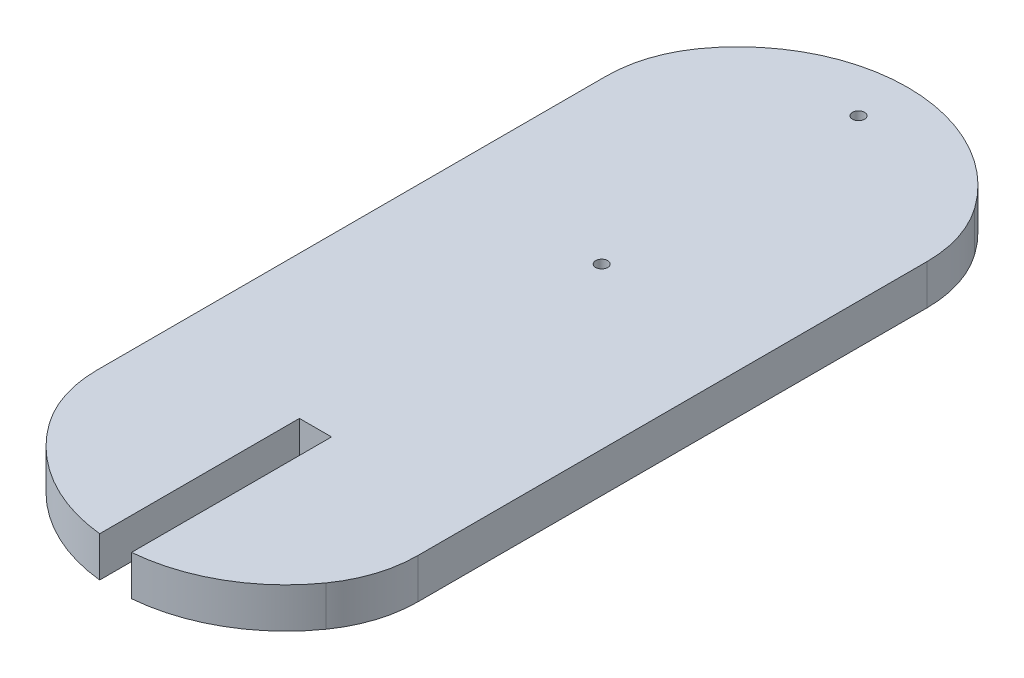
ISO-10303-21;
HEADER;
FILE_DESCRIPTION(('STEP AP214'),'2;1');
FILE_NAME('part.step','',(''),(''),'','','');
FILE_SCHEMA(('AUTOMOTIVE_DESIGN { 1 0 10303 214 1 1 1 1 }'));
ENDSEC;
DATA;
#1=APPLICATION_CONTEXT('core data for automotive mechanical design processes');
#2=APPLICATION_PROTOCOL_DEFINITION('international standard','automotive_design',2000,#1);
#3=PRODUCT_CONTEXT('',#1,'mechanical');
#4=PRODUCT('Part','Part','',(#3));
#5=PRODUCT_RELATED_PRODUCT_CATEGORY('part','',(#4));
#6=PRODUCT_DEFINITION_FORMATION('','',#4);
#7=PRODUCT_DEFINITION_CONTEXT('part definition',#1,'design');
#8=PRODUCT_DEFINITION('design','',#6,#7);
#9=PRODUCT_DEFINITION_SHAPE('','',#8);
#10=(LENGTH_UNIT() NAMED_UNIT(*) SI_UNIT(.MILLI.,.METRE.));
#11=(NAMED_UNIT(*) PLANE_ANGLE_UNIT() SI_UNIT($,.RADIAN.));
#12=(NAMED_UNIT(*) SI_UNIT($,.STERADIAN.) SOLID_ANGLE_UNIT());
#13=UNCERTAINTY_MEASURE_WITH_UNIT(LENGTH_MEASURE(1.E-05),#10,'distance_accuracy_value','');
#14=(GEOMETRIC_REPRESENTATION_CONTEXT(3) GLOBAL_UNCERTAINTY_ASSIGNED_CONTEXT((#13)) GLOBAL_UNIT_ASSIGNED_CONTEXT((#10,
#11,#12)) REPRESENTATION_CONTEXT('',''));
#15=CARTESIAN_POINT('',(0.,0.,0.));
#16=DIRECTION('',(0.,0.,1.));
#17=DIRECTION('',(1.,0.,0.));
#18=AXIS2_PLACEMENT_3D('',#15,#16,#17);
#19=CARTESIAN_POINT('',(0.,5.,28.1826031360937));
#20=DIRECTION('',(0.,-1.,0.));
#21=DIRECTION('',(0.,0.,-1.));
#22=AXIS2_PLACEMENT_3D('',#19,#20,#21);
#23=CYLINDRICAL_SURFACE('',#22,21.13);
#24=CARTESIAN_POINT('',(0.,5.,28.1826031360937));
#25=DIRECTION('',(0.,1.,0.));
#26=DIRECTION('',(0.,0.,1.));
#27=AXIS2_PLACEMENT_3D('',#24,#25,#26);
#28=CIRCLE('',#27,21.13);
#29=CARTESIAN_POINT('',(1.82374823296328,5.,49.2337513799012));
#30=VERTEX_POINT('',#29);
#31=CARTESIAN_POINT('',(17.2349102773246,5.,40.406954559894));
#32=VERTEX_POINT('',#31);
#33=EDGE_CURVE('E164',#30,#32,#28,.T.);
#34=ORIENTED_EDGE('',*,*,#33,.F.);
#35=DIRECTION('',(0.,-1.,0.));
#36=VECTOR('',#35,1.);
#37=CARTESIAN_POINT('',(1.82374823296328,5.,49.2337513799012));
#38=LINE('',#37,#36);
#39=CARTESIAN_POINT('',(1.82374823296328,0.,49.2337513799012));
#40=VERTEX_POINT('',#39);
#41=EDGE_CURVE('E158',#30,#40,#38,.T.);
#42=ORIENTED_EDGE('',*,*,#41,.T.);
#43=CARTESIAN_POINT('',(0.,0.,28.1826031360937));
#44=DIRECTION('',(0.,1.,0.));
#45=DIRECTION('',(0.,0.,1.));
#46=AXIS2_PLACEMENT_3D('',#43,#44,#45);
#47=CIRCLE('',#46,21.13);
#48=CARTESIAN_POINT('',(17.2349102773246,0.,40.406954559894));
#49=VERTEX_POINT('',#48);
#50=EDGE_CURVE('E161',#40,#49,#47,.T.);
#51=ORIENTED_EDGE('',*,*,#50,.T.);
#52=DIRECTION('',(0.,-1.,0.));
#53=VECTOR('',#52,1.);
#54=CARTESIAN_POINT('',(17.2349102773246,5.,40.406954559894));
#55=LINE('',#54,#53);
#56=EDGE_CURVE('E201',#49,#32,#55,.F.);
#57=ORIENTED_EDGE('',*,*,#56,.T.);
#58=EDGE_LOOP('',(#34,#42,#51,#57));
#59=FACE_BOUND('',#58,.T.);
#60=ADVANCED_FACE('F36',(#59),#23,.T.);
#61=CARTESIAN_POINT('',(-17.2349102773246,0.,40.406954559894));
#62=VERTEX_POINT('',#61);
#63=CARTESIAN_POINT('',(-2.17625176703672,0.,49.2002345023173));
#64=VERTEX_POINT('',#63);
#65=EDGE_CURVE('E173',#62,#64,#47,.T.);
#66=ORIENTED_EDGE('',*,*,#65,.T.);
#67=DIRECTION('',(0.,-1.,0.));
#68=VECTOR('',#67,1.);
#69=CARTESIAN_POINT('',(-2.17625176703672,5.,49.2002345023173));
#70=LINE('',#69,#68);
#71=CARTESIAN_POINT('',(-2.17625176703672,5.,49.2002345023173));
#72=VERTEX_POINT('',#71);
#73=EDGE_CURVE('E51',#64,#72,#70,.F.);
#74=ORIENTED_EDGE('',*,*,#73,.T.);
#75=CARTESIAN_POINT('',(-17.2349102773246,5.,40.406954559894));
#76=VERTEX_POINT('',#75);
#77=EDGE_CURVE('E144',#76,#72,#28,.T.);
#78=ORIENTED_EDGE('',*,*,#77,.F.);
#79=DIRECTION('',(0.,-1.,0.));
#80=VECTOR('',#79,1.);
#81=CARTESIAN_POINT('',(-17.2349102773246,5.,40.406954559894));
#82=LINE('',#81,#80);
#83=EDGE_CURVE('E198',#76,#62,#82,.T.);
#84=ORIENTED_EDGE('',*,*,#83,.T.);
#85=EDGE_LOOP('',(#66,#74,#78,#84));
#86=FACE_BOUND('',#85,.T.);
#87=ADVANCED_FACE('F240',(#86),#23,.T.);
#88=CARTESIAN_POINT('',(20.,5.,0.));
#89=DIRECTION('',(-1.,0.,0.));
#90=DIRECTION('',(0.,0.,1.));
#91=AXIS2_PLACEMENT_3D('',#88,#89,#90);
#92=PLANE('',#91);
#93=DIRECTION('',(0.,0.,-1.));
#94=VECTOR('',#93,1.);
#95=CARTESIAN_POINT('',(20.,5.,0.));
#96=LINE('',#95,#94);
#97=CARTESIAN_POINT('',(20.,5.,31.728995669359));
#98=VERTEX_POINT('',#97);
#99=CARTESIAN_POINT('',(20.,5.,-31.7243272605895));
#100=VERTEX_POINT('',#99);
#101=EDGE_CURVE('E163',#98,#100,#96,.T.);
#102=ORIENTED_EDGE('',*,*,#101,.F.);
#103=DIRECTION('',(0.,-1.,0.));
#104=VECTOR('',#103,1.);
#105=CARTESIAN_POINT('',(20.,5.,31.728995669359));
#106=LINE('',#105,#104);
#107=CARTESIAN_POINT('',(20.,0.,31.728995669359));
#108=VERTEX_POINT('',#107);
#109=EDGE_CURVE('E186',#98,#108,#106,.T.);
#110=ORIENTED_EDGE('',*,*,#109,.T.);
#111=DIRECTION('',(0.,0.,-1.));
#112=VECTOR('',#111,1.);
#113=CARTESIAN_POINT('',(20.,0.,0.));
#114=LINE('',#113,#112);
#115=CARTESIAN_POINT('',(20.,0.,-31.7243272605895));
#116=VERTEX_POINT('',#115);
#117=EDGE_CURVE('E176',#108,#116,#114,.T.);
#118=ORIENTED_EDGE('',*,*,#117,.T.);
#119=DIRECTION('',(0.,1.,0.));
#120=VECTOR('',#119,1.);
#121=CARTESIAN_POINT('',(20.,5.,-31.7243272605895));
#122=LINE('',#121,#120);
#123=EDGE_CURVE('E172',#116,#100,#122,.T.);
#124=ORIENTED_EDGE('',*,*,#123,.T.);
#125=EDGE_LOOP('',(#102,#110,#118,#124));
#126=FACE_BOUND('',#125,.T.);
#127=ADVANCED_FACE('F242',(#126),#92,.F.);
#128=CARTESIAN_POINT('',(0.,5.,-28.1720466483781));
#129=DIRECTION('',(0.,-1.,0.));
#130=DIRECTION('',(0.,0.,-1.));
#131=AXIS2_PLACEMENT_3D('',#128,#129,#130);
#132=CYLINDRICAL_SURFACE('',#131,21.1334083141344);
#133=CARTESIAN_POINT('',(0.,0.,-28.1720466483781));
#134=DIRECTION('',(0.,1.,0.));
#135=DIRECTION('',(0.,0.,1.));
#136=AXIS2_PLACEMENT_3D('',#133,#134,#135);
#137=CIRCLE('',#136,21.1334083141344);
#138=CARTESIAN_POINT('',(-17.2281113793065,0.,-40.4118638559239));
#139=VERTEX_POINT('',#138);
#140=CARTESIAN_POINT('',(17.2281113793065,0.,-40.4118638559239));
#141=VERTEX_POINT('',#140);
#142=EDGE_CURVE('E179',#139,#141,#137,.F.);
#143=ORIENTED_EDGE('',*,*,#142,.F.);
#144=DIRECTION('',(0.,-1.,0.));
#145=VECTOR('',#144,1.);
#146=CARTESIAN_POINT('',(-17.2281113793065,5.,-40.4118638559239));
#147=LINE('',#146,#145);
#148=CARTESIAN_POINT('',(-17.2281113793065,5.,-40.4118638559239));
#149=VERTEX_POINT('',#148);
#150=EDGE_CURVE('E44',#139,#149,#147,.F.);
#151=ORIENTED_EDGE('',*,*,#150,.T.);
#152=CARTESIAN_POINT('',(0.,5.,-28.1720466483781));
#153=DIRECTION('',(0.,1.,0.));
#154=DIRECTION('',(0.,0.,1.));
#155=AXIS2_PLACEMENT_3D('',#152,#153,#154);
#156=CIRCLE('',#155,21.1334083141344);
#157=CARTESIAN_POINT('',(17.2281113793065,5.,-40.4118638559239));
#158=VERTEX_POINT('',#157);
#159=EDGE_CURVE('E167',#149,#158,#156,.F.);
#160=ORIENTED_EDGE('',*,*,#159,.T.);
#161=DIRECTION('',(0.,-1.,0.));
#162=VECTOR('',#161,1.);
#163=CARTESIAN_POINT('',(17.2281113793065,5.,-40.4118638559239));
#164=LINE('',#163,#162);
#165=EDGE_CURVE('E216',#158,#141,#164,.T.);
#166=ORIENTED_EDGE('',*,*,#165,.T.);
#167=EDGE_LOOP('',(#143,#151,#160,#166));
#168=FACE_BOUND('',#167,.T.);
#169=ADVANCED_FACE('F221',(#168),#132,.T.);
#170=CARTESIAN_POINT('',(-20.,5.,0.));
#171=DIRECTION('',(-1.,0.,0.));
#172=DIRECTION('',(0.,0.,1.));
#173=AXIS2_PLACEMENT_3D('',#170,#171,#172);
#174=PLANE('',#173);
#175=DIRECTION('',(0.,0.,-1.));
#176=VECTOR('',#175,1.);
#177=CARTESIAN_POINT('',(-20.,0.,0.));
#178=LINE('',#177,#176);
#179=CARTESIAN_POINT('',(-20.,0.,31.728995669359));
#180=VERTEX_POINT('',#179);
#181=CARTESIAN_POINT('',(-20.,0.,-31.7243272605895));
#182=VERTEX_POINT('',#181);
#183=EDGE_CURVE('E182',#180,#182,#178,.T.);
#184=ORIENTED_EDGE('',*,*,#183,.F.);
#185=DIRECTION('',(0.,1.,0.));
#186=VECTOR('',#185,1.);
#187=CARTESIAN_POINT('',(-20.,5.,31.728995669359));
#188=LINE('',#187,#186);
#189=CARTESIAN_POINT('',(-20.,5.,31.728995669359));
#190=VERTEX_POINT('',#189);
#191=EDGE_CURVE('E214',#180,#190,#188,.T.);
#192=ORIENTED_EDGE('',*,*,#191,.T.);
#193=DIRECTION('',(0.,0.,-1.));
#194=VECTOR('',#193,1.);
#195=CARTESIAN_POINT('',(-20.,5.,0.));
#196=LINE('',#195,#194);
#197=CARTESIAN_POINT('',(-20.,5.,-31.7243272605895));
#198=VERTEX_POINT('',#197);
#199=EDGE_CURVE('E170',#190,#198,#196,.T.);
#200=ORIENTED_EDGE('',*,*,#199,.T.);
#201=DIRECTION('',(0.,-1.,0.));
#202=VECTOR('',#201,1.);
#203=CARTESIAN_POINT('',(-20.,5.,-31.7243272605895));
#204=LINE('',#203,#202);
#205=EDGE_CURVE('E211',#198,#182,#204,.T.);
#206=ORIENTED_EDGE('',*,*,#205,.T.);
#207=EDGE_LOOP('',(#184,#192,#200,#206));
#208=FACE_BOUND('',#207,.T.);
#209=ADVANCED_FACE('F229',(#208),#174,.T.);
#210=CARTESIAN_POINT('',(0.,5.,0.));
#211=DIRECTION('',(0.,1.,0.));
#212=DIRECTION('',(0.,0.,1.));
#213=AXIS2_PLACEMENT_3D('',#210,#211,#212);
#214=PLANE('',#213);
#215=CARTESIAN_POINT('',(0.,5.,-43.172046648378));
#216=DIRECTION('',(0.,-1.,0.));
#217=DIRECTION('',(0.,0.,-1.));
#218=AXIS2_PLACEMENT_3D('',#215,#216,#217);
#219=CIRCLE('',#218,0.75);
#220=CARTESIAN_POINT('',(0.,5.,-43.922046648378));
#221=VERTEX_POINT('',#220);
#222=EDGE_CURVE('E154',#221,#221,#219,.T.);
#223=ORIENTED_EDGE('',*,*,#222,.T.);
#224=EDGE_LOOP('',(#223));
#225=FACE_BOUND('',#224,.T.);
#226=CARTESIAN_POINT('',(0.,5.,-11.172046648378));
#227=DIRECTION('',(0.,-1.,0.));
#228=DIRECTION('',(0.,0.,-1.));
#229=AXIS2_PLACEMENT_3D('',#226,#227,#228);
#230=CIRCLE('',#229,0.750000000000001);
#231=CARTESIAN_POINT('',(0.,5.,-11.9220466483781));
#232=VERTEX_POINT('',#231);
#233=EDGE_CURVE('E373',#232,#232,#230,.T.);
#234=ORIENTED_EDGE('',*,*,#233,.T.);
#235=EDGE_LOOP('',(#234));
#236=FACE_BOUND('',#235,.T.);
#237=DIRECTION('',(0.,0.,1.));
#238=VECTOR('',#237,1.);
#239=CARTESIAN_POINT('',(1.82374823296328,5.,49.3126031360937));
#240=LINE('',#239,#238);
#241=CARTESIAN_POINT('',(1.82374823296328,5.,24.3126031360937));
#242=VERTEX_POINT('',#241);
#243=EDGE_CURVE('E133',#242,#30,#240,.T.);
#244=ORIENTED_EDGE('',*,*,#243,.T.);
#245=ORIENTED_EDGE('',*,*,#33,.T.);
#246=CARTESIAN_POINT('',(5.,5.,31.728995669359));
#247=DIRECTION('',(0.,1.,0.));
#248=DIRECTION('',(0.,0.,1.));
#249=AXIS2_PLACEMENT_3D('',#246,#247,#248);
#250=CIRCLE('',#249,15.);
#251=EDGE_CURVE('E209',#32,#98,#250,.T.);
#252=ORIENTED_EDGE('',*,*,#251,.T.);
#253=ORIENTED_EDGE('',*,*,#101,.T.);
#254=CARTESIAN_POINT('',(5.,5.,-31.7243272605895));
#255=DIRECTION('',(0.,1.,0.));
#256=DIRECTION('',(0.,0.,1.));
#257=AXIS2_PLACEMENT_3D('',#254,#255,#256);
#258=CIRCLE('',#257,15.);
#259=EDGE_CURVE('E204',#100,#158,#258,.T.);
#260=ORIENTED_EDGE('',*,*,#259,.T.);
#261=ORIENTED_EDGE('',*,*,#159,.F.);
#262=CARTESIAN_POINT('',(-5.,5.,-31.7243272605895));
#263=DIRECTION('',(0.,1.,0.));
#264=DIRECTION('',(0.,0.,1.));
#265=AXIS2_PLACEMENT_3D('',#262,#263,#264);
#266=CIRCLE('',#265,15.);
#267=EDGE_CURVE('E58',#149,#198,#266,.T.);
#268=ORIENTED_EDGE('',*,*,#267,.T.);
#269=ORIENTED_EDGE('',*,*,#199,.F.);
#270=CARTESIAN_POINT('',(-5.,5.,31.728995669359));
#271=DIRECTION('',(0.,1.,0.));
#272=DIRECTION('',(0.,0.,1.));
#273=AXIS2_PLACEMENT_3D('',#270,#271,#272);
#274=CIRCLE('',#273,15.);
#275=EDGE_CURVE('E207',#190,#76,#274,.T.);
#276=ORIENTED_EDGE('',*,*,#275,.T.);
#277=ORIENTED_EDGE('',*,*,#77,.T.);
#278=DIRECTION('',(0.,0.,-1.));
#279=VECTOR('',#278,1.);
#280=CARTESIAN_POINT('',(-2.17625176703672,5.,24.3126031360937));
#281=LINE('',#280,#279);
#282=CARTESIAN_POINT('',(-2.17625176703672,5.,24.3126031360937));
#283=VERTEX_POINT('',#282);
#284=EDGE_CURVE('E128',#72,#283,#281,.T.);
#285=ORIENTED_EDGE('',*,*,#284,.T.);
#286=DIRECTION('',(1.,0.,0.));
#287=VECTOR('',#286,1.);
#288=CARTESIAN_POINT('',(1.82374823296328,5.,24.3126031360937));
#289=LINE('',#288,#287);
#290=EDGE_CURVE('E136',#283,#242,#289,.T.);
#291=ORIENTED_EDGE('',*,*,#290,.T.);
#292=EDGE_LOOP('',(#244,#245,#252,#253,#260,#261,#268,#269,#276,#277,#285,#291));
#293=FACE_BOUND('',#292,.T.);
#294=ADVANCED_FACE('F142',(#225,#236,#293),#214,.T.);
#295=CARTESIAN_POINT('',(0.,0.,0.));
#296=DIRECTION('',(0.,1.,0.));
#297=DIRECTION('',(0.,0.,1.));
#298=AXIS2_PLACEMENT_3D('',#295,#296,#297);
#299=PLANE('',#298);
#300=CARTESIAN_POINT('',(0.,0.,-43.172046648378));
#301=DIRECTION('',(0.,-1.,0.));
#302=DIRECTION('',(0.,0.,-1.));
#303=AXIS2_PLACEMENT_3D('',#300,#301,#302);
#304=CIRCLE('',#303,0.75);
#305=CARTESIAN_POINT('',(0.,0.,-43.922046648378));
#306=VERTEX_POINT('',#305);
#307=EDGE_CURVE('E372',#306,#306,#304,.T.);
#308=ORIENTED_EDGE('',*,*,#307,.F.);
#309=EDGE_LOOP('',(#308));
#310=FACE_BOUND('',#309,.T.);
#311=CARTESIAN_POINT('',(0.,0.,-11.172046648378));
#312=DIRECTION('',(0.,-1.,0.));
#313=DIRECTION('',(0.,0.,-1.));
#314=AXIS2_PLACEMENT_3D('',#311,#312,#313);
#315=CIRCLE('',#314,0.750000000000001);
#316=CARTESIAN_POINT('',(0.,0.,-11.9220466483781));
#317=VERTEX_POINT('',#316);
#318=EDGE_CURVE('E150',#317,#317,#315,.T.);
#319=ORIENTED_EDGE('',*,*,#318,.F.);
#320=EDGE_LOOP('',(#319));
#321=FACE_BOUND('',#320,.T.);
#322=ORIENTED_EDGE('',*,*,#50,.F.);
#323=DIRECTION('',(0.,0.,1.));
#324=VECTOR('',#323,1.);
#325=CARTESIAN_POINT('',(1.82374823296328,0.,49.3126031360937));
#326=LINE('',#325,#324);
#327=CARTESIAN_POINT('',(1.82374823296328,0.,24.3126031360937));
#328=VERTEX_POINT('',#327);
#329=EDGE_CURVE('E145',#328,#40,#326,.T.);
#330=ORIENTED_EDGE('',*,*,#329,.F.);
#331=DIRECTION('',(1.,0.,0.));
#332=VECTOR('',#331,1.);
#333=CARTESIAN_POINT('',(1.82374823296328,0.,24.3126031360937));
#334=LINE('',#333,#332);
#335=CARTESIAN_POINT('',(-2.17625176703672,0.,24.3126031360937));
#336=VERTEX_POINT('',#335);
#337=EDGE_CURVE('E147',#336,#328,#334,.T.);
#338=ORIENTED_EDGE('',*,*,#337,.F.);
#339=DIRECTION('',(0.,0.,1.));
#340=VECTOR('',#339,1.);
#341=CARTESIAN_POINT('',(-2.17625176703671,0.,0.));
#342=LINE('',#341,#340);
#343=EDGE_CURVE('E11',#336,#64,#342,.T.);
#344=ORIENTED_EDGE('',*,*,#343,.T.);
#345=ORIENTED_EDGE('',*,*,#65,.F.);
#346=CARTESIAN_POINT('',(-5.,0.,31.728995669359));
#347=DIRECTION('',(0.,1.,0.));
#348=DIRECTION('',(0.,0.,1.));
#349=AXIS2_PLACEMENT_3D('',#346,#347,#348);
#350=CIRCLE('',#349,15.);
#351=EDGE_CURVE('E193',#62,#180,#350,.F.);
#352=ORIENTED_EDGE('',*,*,#351,.T.);
#353=ORIENTED_EDGE('',*,*,#183,.T.);
#354=CARTESIAN_POINT('',(-5.,0.,-31.7243272605895));
#355=DIRECTION('',(0.,1.,0.));
#356=DIRECTION('',(0.,0.,1.));
#357=AXIS2_PLACEMENT_3D('',#354,#355,#356);
#358=CIRCLE('',#357,15.);
#359=EDGE_CURVE('E191',#182,#139,#358,.F.);
#360=ORIENTED_EDGE('',*,*,#359,.T.);
#361=ORIENTED_EDGE('',*,*,#142,.T.);
#362=CARTESIAN_POINT('',(5.,0.,-31.7243272605895));
#363=DIRECTION('',(0.,1.,0.));
#364=DIRECTION('',(0.,0.,1.));
#365=AXIS2_PLACEMENT_3D('',#362,#363,#364);
#366=CIRCLE('',#365,15.);
#367=EDGE_CURVE('E189',#141,#116,#366,.F.);
#368=ORIENTED_EDGE('',*,*,#367,.T.);
#369=ORIENTED_EDGE('',*,*,#117,.F.);
#370=CARTESIAN_POINT('',(5.,0.,31.728995669359));
#371=DIRECTION('',(0.,1.,0.));
#372=DIRECTION('',(0.,0.,1.));
#373=AXIS2_PLACEMENT_3D('',#370,#371,#372);
#374=CIRCLE('',#373,15.);
#375=EDGE_CURVE('E195',#108,#49,#374,.F.);
#376=ORIENTED_EDGE('',*,*,#375,.T.);
#377=EDGE_LOOP('',(#322,#330,#338,#344,#345,#352,#353,#360,#361,#368,#369,#376));
#378=FACE_BOUND('',#377,.T.);
#379=ADVANCED_FACE('F233',(#310,#321,#378),#299,.F.);
#380=CARTESIAN_POINT('',(5.,5.,31.728995669359));
#381=DIRECTION('',(0.,-1.,0.));
#382=DIRECTION('',(0.,0.,-1.));
#383=AXIS2_PLACEMENT_3D('',#380,#381,#382);
#384=CYLINDRICAL_SURFACE('',#383,15.);
#385=ORIENTED_EDGE('',*,*,#251,.F.);
#386=ORIENTED_EDGE('',*,*,#56,.F.);
#387=ORIENTED_EDGE('',*,*,#375,.F.);
#388=ORIENTED_EDGE('',*,*,#109,.F.);
#389=EDGE_LOOP('',(#385,#386,#387,#388));
#390=FACE_BOUND('',#389,.T.);
#391=ADVANCED_FACE('F254',(#390),#384,.T.);
#392=CARTESIAN_POINT('',(-5.,5.,31.728995669359));
#393=DIRECTION('',(0.,-1.,0.));
#394=DIRECTION('',(0.,0.,-1.));
#395=AXIS2_PLACEMENT_3D('',#392,#393,#394);
#396=CYLINDRICAL_SURFACE('',#395,15.);
#397=ORIENTED_EDGE('',*,*,#275,.F.);
#398=ORIENTED_EDGE('',*,*,#191,.F.);
#399=ORIENTED_EDGE('',*,*,#351,.F.);
#400=ORIENTED_EDGE('',*,*,#83,.F.);
#401=EDGE_LOOP('',(#397,#398,#399,#400));
#402=FACE_BOUND('',#401,.T.);
#403=ADVANCED_FACE('F238',(#402),#396,.T.);
#404=CARTESIAN_POINT('',(-5.,5.,-31.7243272605895));
#405=DIRECTION('',(0.,-1.,0.));
#406=DIRECTION('',(0.,0.,-1.));
#407=AXIS2_PLACEMENT_3D('',#404,#405,#406);
#408=CYLINDRICAL_SURFACE('',#407,15.);
#409=ORIENTED_EDGE('',*,*,#267,.F.);
#410=ORIENTED_EDGE('',*,*,#150,.F.);
#411=ORIENTED_EDGE('',*,*,#359,.F.);
#412=ORIENTED_EDGE('',*,*,#205,.F.);
#413=EDGE_LOOP('',(#409,#410,#411,#412));
#414=FACE_BOUND('',#413,.T.);
#415=ADVANCED_FACE('F226',(#414),#408,.T.);
#416=CARTESIAN_POINT('',(5.,5.,-31.7243272605895));
#417=DIRECTION('',(0.,-1.,0.));
#418=DIRECTION('',(0.,0.,-1.));
#419=AXIS2_PLACEMENT_3D('',#416,#417,#418);
#420=CYLINDRICAL_SURFACE('',#419,15.);
#421=ORIENTED_EDGE('',*,*,#259,.F.);
#422=ORIENTED_EDGE('',*,*,#123,.F.);
#423=ORIENTED_EDGE('',*,*,#367,.F.);
#424=ORIENTED_EDGE('',*,*,#165,.F.);
#425=EDGE_LOOP('',(#421,#422,#423,#424));
#426=FACE_BOUND('',#425,.T.);
#427=ADVANCED_FACE('F38',(#426),#420,.T.);
#428=CARTESIAN_POINT('',(1.82374823296328,5.,49.3126031360937));
#429=DIRECTION('',(1.,0.,0.));
#430=DIRECTION('',(0.,0.,-1.));
#431=AXIS2_PLACEMENT_3D('',#428,#429,#430);
#432=PLANE('',#431);
#433=ORIENTED_EDGE('',*,*,#243,.F.);
#434=DIRECTION('',(0.,-1.,0.));
#435=VECTOR('',#434,1.);
#436=CARTESIAN_POINT('',(1.82374823296328,5.,24.3126031360937));
#437=LINE('',#436,#435);
#438=EDGE_CURVE('E132',#242,#328,#437,.T.);
#439=ORIENTED_EDGE('',*,*,#438,.T.);
#440=ORIENTED_EDGE('',*,*,#329,.T.);
#441=ORIENTED_EDGE('',*,*,#41,.F.);
#442=EDGE_LOOP('',(#433,#439,#440,#441));
#443=FACE_BOUND('',#442,.T.);
#444=ADVANCED_FACE('F263',(#443),#432,.F.);
#445=CARTESIAN_POINT('',(-2.17625176703672,5.,24.3126031360937));
#446=DIRECTION('',(-1.,0.,0.));
#447=DIRECTION('',(0.,0.,1.));
#448=AXIS2_PLACEMENT_3D('',#445,#446,#447);
#449=PLANE('',#448);
#450=ORIENTED_EDGE('',*,*,#343,.F.);
#451=DIRECTION('',(0.,-1.,0.));
#452=VECTOR('',#451,1.);
#453=CARTESIAN_POINT('',(-2.17625176703672,5.,24.3126031360937));
#454=LINE('',#453,#452);
#455=EDGE_CURVE('E124',#283,#336,#454,.T.);
#456=ORIENTED_EDGE('',*,*,#455,.F.);
#457=ORIENTED_EDGE('',*,*,#284,.F.);
#458=ORIENTED_EDGE('',*,*,#73,.F.);
#459=EDGE_LOOP('',(#450,#456,#457,#458));
#460=FACE_BOUND('',#459,.T.);
#461=ADVANCED_FACE('F126',(#460),#449,.F.);
#462=CARTESIAN_POINT('',(1.82374823296328,5.,24.3126031360937));
#463=DIRECTION('',(0.,0.,-1.));
#464=DIRECTION('',(-1.,0.,0.));
#465=AXIS2_PLACEMENT_3D('',#462,#463,#464);
#466=PLANE('',#465);
#467=ORIENTED_EDGE('',*,*,#337,.T.);
#468=ORIENTED_EDGE('',*,*,#438,.F.);
#469=ORIENTED_EDGE('',*,*,#290,.F.);
#470=ORIENTED_EDGE('',*,*,#455,.T.);
#471=EDGE_LOOP('',(#467,#468,#469,#470));
#472=FACE_BOUND('',#471,.T.);
#473=ADVANCED_FACE('F137',(#472),#466,.F.);
#474=CARTESIAN_POINT('',(0.,5.,-11.172046648378));
#475=DIRECTION('',(0.,-1.,0.));
#476=DIRECTION('',(0.,0.,-1.));
#477=AXIS2_PLACEMENT_3D('',#474,#475,#476);
#478=CYLINDRICAL_SURFACE('',#477,0.750000000000001);
#479=ORIENTED_EDGE('',*,*,#233,.F.);
#480=EDGE_LOOP('',(#479));
#481=FACE_BOUND('',#480,.T.);
#482=ORIENTED_EDGE('',*,*,#318,.T.);
#483=EDGE_LOOP('',(#482));
#484=FACE_BOUND('',#483,.T.);
#485=ADVANCED_FACE('F284',(#481,#484),#478,.F.);
#486=CARTESIAN_POINT('',(0.,5.,-43.172046648378));
#487=DIRECTION('',(0.,-1.,0.));
#488=DIRECTION('',(0.,0.,-1.));
#489=AXIS2_PLACEMENT_3D('',#486,#487,#488);
#490=CYLINDRICAL_SURFACE('',#489,0.75);
#491=ORIENTED_EDGE('',*,*,#222,.F.);
#492=EDGE_LOOP('',(#491));
#493=FACE_BOUND('',#492,.T.);
#494=ORIENTED_EDGE('',*,*,#307,.T.);
#495=EDGE_LOOP('',(#494));
#496=FACE_BOUND('',#495,.T.);
#497=ADVANCED_FACE('F354',(#493,#496),#490,.F.);
#498=CLOSED_SHELL('',(#60,#87,#127,#169,#209,#294,#379,#391,#403,#415,#427,#444,#461,#473,#485,#497));
#499=MANIFOLD_SOLID_BREP('B2',#498);
#500=ADVANCED_BREP_SHAPE_REPRESENTATION('',(#18,#499),#14);
#501=SHAPE_DEFINITION_REPRESENTATION(#9,#500);
ENDSEC;
END-ISO-10303-21;
